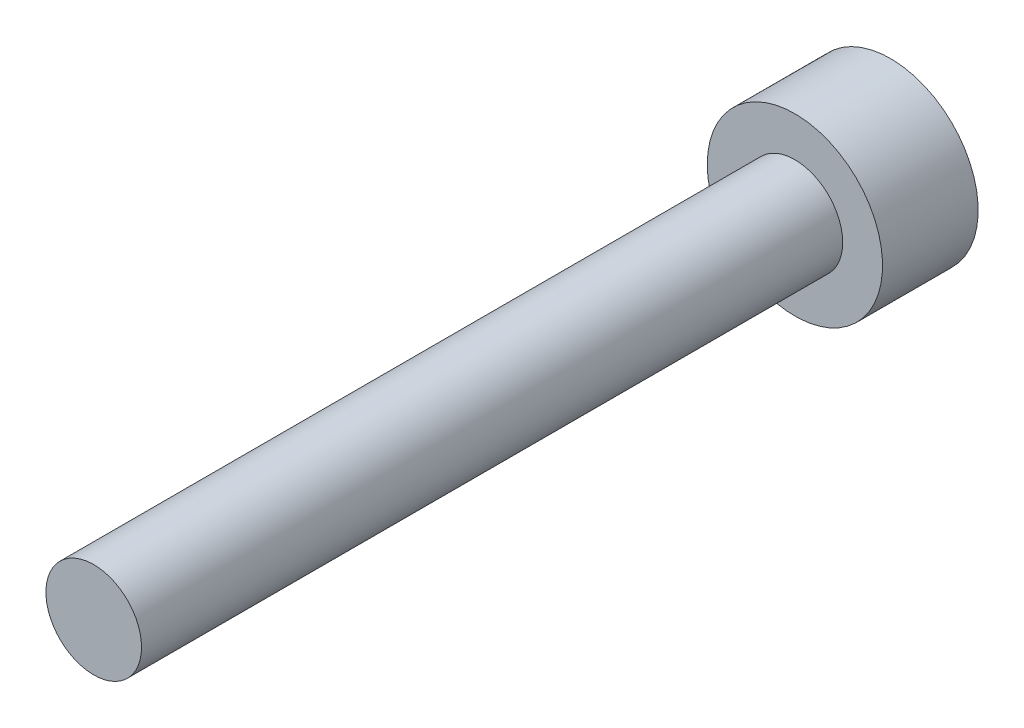
ISO-10303-21;
HEADER;
FILE_DESCRIPTION(('STEP AP214'),'2;1');
FILE_NAME('part.step','',(''),(''),'','','');
FILE_SCHEMA(('AUTOMOTIVE_DESIGN { 1 0 10303 214 1 1 1 1 }'));
ENDSEC;
DATA;
#1=APPLICATION_CONTEXT('core data for automotive mechanical design processes');
#2=APPLICATION_PROTOCOL_DEFINITION('international standard','automotive_design',2000,#1);
#3=PRODUCT_CONTEXT('',#1,'mechanical');
#4=PRODUCT('Part','Part','',(#3));
#5=PRODUCT_RELATED_PRODUCT_CATEGORY('part','',(#4));
#6=PRODUCT_DEFINITION_FORMATION('','',#4);
#7=PRODUCT_DEFINITION_CONTEXT('part definition',#1,'design');
#8=PRODUCT_DEFINITION('design','',#6,#7);
#9=PRODUCT_DEFINITION_SHAPE('','',#8);
#10=(LENGTH_UNIT() NAMED_UNIT(*) SI_UNIT(.MILLI.,.METRE.));
#11=(NAMED_UNIT(*) PLANE_ANGLE_UNIT() SI_UNIT($,.RADIAN.));
#12=(NAMED_UNIT(*) SI_UNIT($,.STERADIAN.) SOLID_ANGLE_UNIT());
#13=UNCERTAINTY_MEASURE_WITH_UNIT(LENGTH_MEASURE(1.E-05),#10,'distance_accuracy_value','');
#14=(GEOMETRIC_REPRESENTATION_CONTEXT(3) GLOBAL_UNCERTAINTY_ASSIGNED_CONTEXT((#13)) GLOBAL_UNIT_ASSIGNED_CONTEXT((#10,
#11,#12)) REPRESENTATION_CONTEXT('',''));
#15=CARTESIAN_POINT('',(0.,0.,0.));
#16=DIRECTION('',(0.,0.,1.));
#17=DIRECTION('',(1.,0.,0.));
#18=AXIS2_PLACEMENT_3D('',#15,#16,#17);
#19=CARTESIAN_POINT('',(0.,0.,0.));
#20=DIRECTION('',(0.,0.,1.));
#21=DIRECTION('',(1.,0.,0.));
#22=AXIS2_PLACEMENT_3D('',#19,#20,#21);
#23=PLANE('',#22);
#24=DIRECTION('',(-0.5,-0.866025403784439,0.));
#25=VECTOR('',#24,1.);
#26=CARTESIAN_POINT('',(0.625,-1.08253175473055,0.));
#27=LINE('',#26,#25);
#28=CARTESIAN_POINT('',(1.25,0.,0.));
#29=VERTEX_POINT('',#28);
#30=CARTESIAN_POINT('',(0.625,-1.08253175473055,0.));
#31=VERTEX_POINT('',#30);
#32=EDGE_CURVE('E101',#29,#31,#27,.T.);
#33=ORIENTED_EDGE('',*,*,#32,.F.);
#34=DIRECTION('',(0.5,-0.866025403784439,0.));
#35=VECTOR('',#34,1.);
#36=CARTESIAN_POINT('',(1.25,0.,0.));
#37=LINE('',#36,#35);
#38=CARTESIAN_POINT('',(0.625,1.08253175473055,0.));
#39=VERTEX_POINT('',#38);
#40=EDGE_CURVE('E142',#39,#29,#37,.T.);
#41=ORIENTED_EDGE('',*,*,#40,.F.);
#42=DIRECTION('',(1.,0.,0.));
#43=VECTOR('',#42,1.);
#44=CARTESIAN_POINT('',(0.625,1.08253175473055,0.));
#45=LINE('',#44,#43);
#46=CARTESIAN_POINT('',(-0.625,1.08253175473055,0.));
#47=VERTEX_POINT('',#46);
#48=EDGE_CURVE('E162',#47,#39,#45,.T.);
#49=ORIENTED_EDGE('',*,*,#48,.F.);
#50=DIRECTION('',(0.5,0.866025403784439,0.));
#51=VECTOR('',#50,1.);
#52=CARTESIAN_POINT('',(-0.625,1.08253175473055,0.));
#53=LINE('',#52,#51);
#54=CARTESIAN_POINT('',(-1.25,0.,0.));
#55=VERTEX_POINT('',#54);
#56=EDGE_CURVE('E167',#55,#47,#53,.T.);
#57=ORIENTED_EDGE('',*,*,#56,.F.);
#58=DIRECTION('',(-0.5,0.866025403784439,0.));
#59=VECTOR('',#58,1.);
#60=CARTESIAN_POINT('',(-1.25,0.,0.));
#61=LINE('',#60,#59);
#62=CARTESIAN_POINT('',(-0.625,-1.08253175473055,0.));
#63=VERTEX_POINT('',#62);
#64=EDGE_CURVE('E198',#63,#55,#61,.T.);
#65=ORIENTED_EDGE('',*,*,#64,.F.);
#66=DIRECTION('',(-1.,0.,0.));
#67=VECTOR('',#66,1.);
#68=CARTESIAN_POINT('',(-0.625,-1.08253175473055,0.));
#69=LINE('',#68,#67);
#70=EDGE_CURVE('E21',#31,#63,#69,.T.);
#71=ORIENTED_EDGE('',*,*,#70,.F.);
#72=EDGE_LOOP('',(#33,#41,#49,#57,#65,#71));
#73=FACE_BOUND('',#72,.T.);
#74=CARTESIAN_POINT('',(0.,0.,0.));
#75=DIRECTION('',(0.,0.,1.));
#76=DIRECTION('',(1.,0.,0.));
#77=AXIS2_PLACEMENT_3D('',#74,#75,#76);
#78=CIRCLE('',#77,2.75);
#79=CARTESIAN_POINT('',(-2.75,0.,0.));
#80=VERTEX_POINT('',#79);
#81=EDGE_CURVE('E11',#80,#80,#78,.T.);
#82=ORIENTED_EDGE('',*,*,#81,.F.);
#83=EDGE_LOOP('',(#82));
#84=FACE_BOUND('',#83,.T.);
#85=ADVANCED_FACE('F17',(#73,#84),#23,.F.);
#86=CARTESIAN_POINT('',(0.,0.,3.));
#87=DIRECTION('',(0.,0.,1.));
#88=DIRECTION('',(1.,0.,0.));
#89=AXIS2_PLACEMENT_3D('',#86,#87,#88);
#90=PLANE('',#89);
#91=CARTESIAN_POINT('',(0.,0.,3.));
#92=DIRECTION('',(0.,0.,-1.));
#93=DIRECTION('',(-1.,0.,0.));
#94=AXIS2_PLACEMENT_3D('',#91,#92,#93);
#95=CIRCLE('',#94,1.5);
#96=CARTESIAN_POINT('',(1.5,0.,3.));
#97=VERTEX_POINT('',#96);
#98=EDGE_CURVE('E136',#97,#97,#95,.T.);
#99=ORIENTED_EDGE('',*,*,#98,.T.);
#100=EDGE_LOOP('',(#99));
#101=FACE_BOUND('',#100,.T.);
#102=CARTESIAN_POINT('',(0.,0.,3.));
#103=DIRECTION('',(0.,0.,1.));
#104=DIRECTION('',(1.,0.,0.));
#105=AXIS2_PLACEMENT_3D('',#102,#103,#104);
#106=CIRCLE('',#105,2.75);
#107=CARTESIAN_POINT('',(-2.75,0.,3.));
#108=VERTEX_POINT('',#107);
#109=EDGE_CURVE('E131',#108,#108,#106,.T.);
#110=ORIENTED_EDGE('',*,*,#109,.T.);
#111=EDGE_LOOP('',(#110));
#112=FACE_BOUND('',#111,.T.);
#113=ADVANCED_FACE('F182',(#101,#112),#90,.T.);
#114=CARTESIAN_POINT('',(0.,0.,0.));
#115=DIRECTION('',(0.,0.,1.));
#116=DIRECTION('',(1.,0.,0.));
#117=AXIS2_PLACEMENT_3D('',#114,#115,#116);
#118=CYLINDRICAL_SURFACE('',#117,2.75);
#119=ORIENTED_EDGE('',*,*,#109,.F.);
#120=DIRECTION('',(0.,0.,-1.));
#121=VECTOR('',#120,1.);
#122=CARTESIAN_POINT('',(-2.75,0.,0.));
#123=LINE('',#122,#121);
#124=EDGE_CURVE('E28',#108,#80,#123,.T.);
#125=ORIENTED_EDGE('',*,*,#124,.T.);
#126=ORIENTED_EDGE('',*,*,#81,.T.);
#127=ORIENTED_EDGE('',*,*,#124,.F.);
#128=EDGE_LOOP('',(#119,#125,#126,#127));
#129=FACE_BOUND('',#128,.T.);
#130=ADVANCED_FACE('F185',(#129),#118,.T.);
#131=CARTESIAN_POINT('',(1.25,0.,0.));
#132=DIRECTION('',(-0.866025403784439,0.5,0.));
#133=DIRECTION('',(0.,0.,1.));
#134=AXIS2_PLACEMENT_3D('',#131,#132,#133);
#135=PLANE('',#134);
#136=ORIENTED_EDGE('',*,*,#32,.T.);
#137=DIRECTION('',(0.,0.,1.));
#138=VECTOR('',#137,1.);
#139=CARTESIAN_POINT('',(0.625,-1.08253175473055,0.));
#140=LINE('',#139,#138);
#141=CARTESIAN_POINT('',(0.625,-1.08253175473055,3.));
#142=VERTEX_POINT('',#141);
#143=EDGE_CURVE('E94',#31,#142,#140,.T.);
#144=ORIENTED_EDGE('',*,*,#143,.T.);
#145=DIRECTION('',(-0.5,-0.866025403784439,0.));
#146=VECTOR('',#145,1.);
#147=CARTESIAN_POINT('',(0.625,-1.08253175473055,3.));
#148=LINE('',#147,#146);
#149=CARTESIAN_POINT('',(1.25,0.,3.));
#150=VERTEX_POINT('',#149);
#151=EDGE_CURVE('E99',#150,#142,#148,.T.);
#152=ORIENTED_EDGE('',*,*,#151,.F.);
#153=DIRECTION('',(0.,0.,1.));
#154=VECTOR('',#153,1.);
#155=CARTESIAN_POINT('',(1.25,0.,0.));
#156=LINE('',#155,#154);
#157=EDGE_CURVE('E138',#29,#150,#156,.T.);
#158=ORIENTED_EDGE('',*,*,#157,.F.);
#159=EDGE_LOOP('',(#136,#144,#152,#158));
#160=FACE_BOUND('',#159,.T.);
#161=ADVANCED_FACE('F96',(#160),#135,.T.);
#162=CARTESIAN_POINT('',(0.625,-1.08253175473055,0.));
#163=DIRECTION('',(0.,1.,0.));
#164=DIRECTION('',(1.,0.,0.));
#165=AXIS2_PLACEMENT_3D('',#162,#163,#164);
#166=PLANE('',#165);
#167=ORIENTED_EDGE('',*,*,#70,.T.);
#168=DIRECTION('',(0.,0.,1.));
#169=VECTOR('',#168,1.);
#170=CARTESIAN_POINT('',(-0.625,-1.08253175473055,0.));
#171=LINE('',#170,#169);
#172=CARTESIAN_POINT('',(-0.625,-1.08253175473055,3.));
#173=VERTEX_POINT('',#172);
#174=EDGE_CURVE('E110',#63,#173,#171,.T.);
#175=ORIENTED_EDGE('',*,*,#174,.T.);
#176=DIRECTION('',(-1.,0.,0.));
#177=VECTOR('',#176,1.);
#178=CARTESIAN_POINT('',(-0.625,-1.08253175473055,3.));
#179=LINE('',#178,#177);
#180=EDGE_CURVE('E107',#142,#173,#179,.T.);
#181=ORIENTED_EDGE('',*,*,#180,.F.);
#182=ORIENTED_EDGE('',*,*,#143,.F.);
#183=EDGE_LOOP('',(#167,#175,#181,#182));
#184=FACE_BOUND('',#183,.T.);
#185=ADVANCED_FACE('F108',(#184),#166,.T.);
#186=CARTESIAN_POINT('',(-0.625,-1.08253175473055,0.));
#187=DIRECTION('',(0.866025403784439,0.5,0.));
#188=DIRECTION('',(0.,0.,-1.));
#189=AXIS2_PLACEMENT_3D('',#186,#187,#188);
#190=PLANE('',#189);
#191=ORIENTED_EDGE('',*,*,#64,.T.);
#192=DIRECTION('',(0.,0.,1.));
#193=VECTOR('',#192,1.);
#194=CARTESIAN_POINT('',(-1.25,0.,0.));
#195=LINE('',#194,#193);
#196=CARTESIAN_POINT('',(-1.25,0.,3.));
#197=VERTEX_POINT('',#196);
#198=EDGE_CURVE('E170',#55,#197,#195,.T.);
#199=ORIENTED_EDGE('',*,*,#198,.T.);
#200=DIRECTION('',(-0.5,0.866025403784439,0.));
#201=VECTOR('',#200,1.);
#202=CARTESIAN_POINT('',(-1.25,0.,3.));
#203=LINE('',#202,#201);
#204=EDGE_CURVE('E115',#173,#197,#203,.T.);
#205=ORIENTED_EDGE('',*,*,#204,.F.);
#206=ORIENTED_EDGE('',*,*,#174,.F.);
#207=EDGE_LOOP('',(#191,#199,#205,#206));
#208=FACE_BOUND('',#207,.T.);
#209=ADVANCED_FACE('F214',(#208),#190,.T.);
#210=CARTESIAN_POINT('',(-1.25,0.,0.));
#211=DIRECTION('',(0.866025403784439,-0.5,0.));
#212=DIRECTION('',(0.,0.,-1.));
#213=AXIS2_PLACEMENT_3D('',#210,#211,#212);
#214=PLANE('',#213);
#215=ORIENTED_EDGE('',*,*,#56,.T.);
#216=DIRECTION('',(0.,0.,1.));
#217=VECTOR('',#216,1.);
#218=CARTESIAN_POINT('',(-0.625,1.08253175473055,0.));
#219=LINE('',#218,#217);
#220=CARTESIAN_POINT('',(-0.625,1.08253175473055,3.));
#221=VERTEX_POINT('',#220);
#222=EDGE_CURVE('E163',#47,#221,#219,.T.);
#223=ORIENTED_EDGE('',*,*,#222,.T.);
#224=DIRECTION('',(0.5,0.866025403784439,0.));
#225=VECTOR('',#224,1.);
#226=CARTESIAN_POINT('',(-0.625,1.08253175473055,3.));
#227=LINE('',#226,#225);
#228=EDGE_CURVE('E143',#197,#221,#227,.T.);
#229=ORIENTED_EDGE('',*,*,#228,.F.);
#230=ORIENTED_EDGE('',*,*,#198,.F.);
#231=EDGE_LOOP('',(#215,#223,#229,#230));
#232=FACE_BOUND('',#231,.T.);
#233=ADVANCED_FACE('F222',(#232),#214,.T.);
#234=CARTESIAN_POINT('',(-0.625,1.08253175473055,0.));
#235=DIRECTION('',(0.,-1.,0.));
#236=DIRECTION('',(-1.,0.,0.));
#237=AXIS2_PLACEMENT_3D('',#234,#235,#236);
#238=PLANE('',#237);
#239=ORIENTED_EDGE('',*,*,#48,.T.);
#240=DIRECTION('',(0.,0.,1.));
#241=VECTOR('',#240,1.);
#242=CARTESIAN_POINT('',(0.625,1.08253175473055,0.));
#243=LINE('',#242,#241);
#244=CARTESIAN_POINT('',(0.625,1.08253175473055,3.));
#245=VERTEX_POINT('',#244);
#246=EDGE_CURVE('E141',#39,#245,#243,.T.);
#247=ORIENTED_EDGE('',*,*,#246,.T.);
#248=DIRECTION('',(1.,0.,0.));
#249=VECTOR('',#248,1.);
#250=CARTESIAN_POINT('',(0.625,1.08253175473055,3.));
#251=LINE('',#250,#249);
#252=EDGE_CURVE('E146',#221,#245,#251,.T.);
#253=ORIENTED_EDGE('',*,*,#252,.F.);
#254=ORIENTED_EDGE('',*,*,#222,.F.);
#255=EDGE_LOOP('',(#239,#247,#253,#254));
#256=FACE_BOUND('',#255,.T.);
#257=ADVANCED_FACE('F225',(#256),#238,.T.);
#258=CARTESIAN_POINT('',(0.625,1.08253175473055,0.));
#259=DIRECTION('',(-0.866025403784439,-0.5,0.));
#260=DIRECTION('',(-0.5,0.866025403784439,0.));
#261=AXIS2_PLACEMENT_3D('',#258,#259,#260);
#262=PLANE('',#261);
#263=ORIENTED_EDGE('',*,*,#40,.T.);
#264=ORIENTED_EDGE('',*,*,#157,.T.);
#265=DIRECTION('',(0.5,-0.866025403784439,0.));
#266=VECTOR('',#265,1.);
#267=CARTESIAN_POINT('',(1.25,0.,3.));
#268=LINE('',#267,#266);
#269=EDGE_CURVE('E119',#245,#150,#268,.T.);
#270=ORIENTED_EDGE('',*,*,#269,.F.);
#271=ORIENTED_EDGE('',*,*,#246,.F.);
#272=EDGE_LOOP('',(#263,#264,#270,#271));
#273=FACE_BOUND('',#272,.T.);
#274=ADVANCED_FACE('F229',(#273),#262,.T.);
#275=CARTESIAN_POINT('',(0.,0.,25.));
#276=DIRECTION('',(0.,0.,1.));
#277=DIRECTION('',(1.,0.,0.));
#278=AXIS2_PLACEMENT_3D('',#275,#276,#277);
#279=PLANE('',#278);
#280=CARTESIAN_POINT('',(0.,0.,25.));
#281=DIRECTION('',(0.,0.,1.));
#282=DIRECTION('',(-1.,0.,0.));
#283=AXIS2_PLACEMENT_3D('',#280,#281,#282);
#284=CIRCLE('',#283,1.5);
#285=CARTESIAN_POINT('',(1.5,0.,25.));
#286=VERTEX_POINT('',#285);
#287=EDGE_CURVE('E137',#286,#286,#284,.T.);
#288=ORIENTED_EDGE('',*,*,#287,.T.);
#289=EDGE_LOOP('',(#288));
#290=FACE_BOUND('',#289,.T.);
#291=ADVANCED_FACE('F177',(#290),#279,.T.);
#292=CARTESIAN_POINT('',(0.,0.,3.));
#293=DIRECTION('',(0.,0.,1.));
#294=DIRECTION('',(-1.,0.,0.));
#295=AXIS2_PLACEMENT_3D('',#292,#293,#294);
#296=CYLINDRICAL_SURFACE('',#295,1.5);
#297=ORIENTED_EDGE('',*,*,#287,.F.);
#298=DIRECTION('',(0.,0.,-1.));
#299=VECTOR('',#298,1.);
#300=CARTESIAN_POINT('',(1.5,0.,3.));
#301=LINE('',#300,#299);
#302=EDGE_CURVE('E132',#286,#97,#301,.T.);
#303=ORIENTED_EDGE('',*,*,#302,.T.);
#304=ORIENTED_EDGE('',*,*,#98,.F.);
#305=ORIENTED_EDGE('',*,*,#302,.F.);
#306=EDGE_LOOP('',(#297,#303,#304,#305));
#307=FACE_BOUND('',#306,.T.);
#308=ADVANCED_FACE('F19',(#307),#296,.T.);
#309=CARTESIAN_POINT('',(0.,0.,3.));
#310=DIRECTION('',(0.,0.,1.));
#311=DIRECTION('',(1.,0.,0.));
#312=AXIS2_PLACEMENT_3D('',#309,#310,#311);
#313=PLANE('',#312);
#314=ORIENTED_EDGE('',*,*,#269,.T.);
#315=ORIENTED_EDGE('',*,*,#151,.T.);
#316=ORIENTED_EDGE('',*,*,#180,.T.);
#317=ORIENTED_EDGE('',*,*,#204,.T.);
#318=ORIENTED_EDGE('',*,*,#228,.T.);
#319=ORIENTED_EDGE('',*,*,#252,.T.);
#320=EDGE_LOOP('',(#314,#315,#316,#317,#318,#319));
#321=FACE_BOUND('',#320,.T.);
#322=ADVANCED_FACE('F116',(#321),#313,.F.);
#323=CLOSED_SHELL('',(#85,#113,#130,#161,#185,#209,#233,#257,#274,#291,#308,#322));
#324=MANIFOLD_SOLID_BREP('B1',#323);
#325=ADVANCED_BREP_SHAPE_REPRESENTATION('',(#18,#324),#14);
#326=SHAPE_DEFINITION_REPRESENTATION(#9,#325);
ENDSEC;
END-ISO-10303-21;
